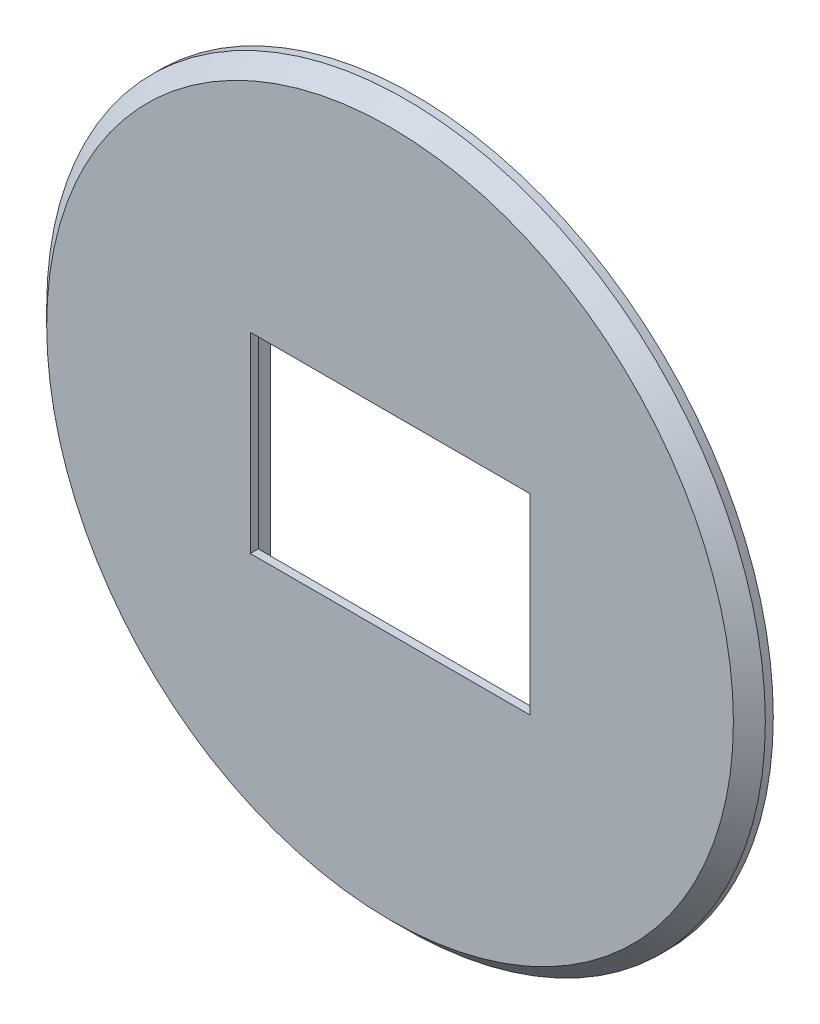
ISO-10303-21;
HEADER;
FILE_DESCRIPTION(('STEP AP214'),'2;1');
FILE_NAME('part.step','',(''),(''),'','','');
FILE_SCHEMA(('AUTOMOTIVE_DESIGN { 1 0 10303 214 1 1 1 1 }'));
ENDSEC;
DATA;
#1=APPLICATION_CONTEXT('core data for automotive mechanical design processes');
#2=APPLICATION_PROTOCOL_DEFINITION('international standard','automotive_design',2000,#1);
#3=PRODUCT_CONTEXT('',#1,'mechanical');
#4=PRODUCT('Part','Part','',(#3));
#5=PRODUCT_RELATED_PRODUCT_CATEGORY('part','',(#4));
#6=PRODUCT_DEFINITION_FORMATION('','',#4);
#7=PRODUCT_DEFINITION_CONTEXT('part definition',#1,'design');
#8=PRODUCT_DEFINITION('design','',#6,#7);
#9=PRODUCT_DEFINITION_SHAPE('','',#8);
#10=(LENGTH_UNIT() NAMED_UNIT(*) SI_UNIT(.MILLI.,.METRE.));
#11=(NAMED_UNIT(*) PLANE_ANGLE_UNIT() SI_UNIT($,.RADIAN.));
#12=(NAMED_UNIT(*) SI_UNIT($,.STERADIAN.) SOLID_ANGLE_UNIT());
#13=UNCERTAINTY_MEASURE_WITH_UNIT(LENGTH_MEASURE(1.E-05),#10,'distance_accuracy_value','');
#14=(GEOMETRIC_REPRESENTATION_CONTEXT(3) GLOBAL_UNCERTAINTY_ASSIGNED_CONTEXT((#13)) GLOBAL_UNIT_ASSIGNED_CONTEXT((#10,
#11,#12)) REPRESENTATION_CONTEXT('',''));
#15=CARTESIAN_POINT('',(0.,0.,0.));
#16=DIRECTION('',(0.,0.,1.));
#17=DIRECTION('',(1.,0.,0.));
#18=AXIS2_PLACEMENT_3D('',#15,#16,#17);
#19=CARTESIAN_POINT('',(17.5,12.,0.));
#20=DIRECTION('',(1.,0.,0.));
#21=DIRECTION('',(0.,0.,-1.));
#22=AXIS2_PLACEMENT_3D('',#19,#20,#21);
#23=PLANE('',#22);
#24=DIRECTION('',(0.,1.,0.));
#25=VECTOR('',#24,1.);
#26=CARTESIAN_POINT('',(17.5,12.,2.));
#27=LINE('',#26,#25);
#28=CARTESIAN_POINT('',(17.5,-12.,2.));
#29=VERTEX_POINT('',#28);
#30=CARTESIAN_POINT('',(17.5,12.,2.));
#31=VERTEX_POINT('',#30);
#32=EDGE_CURVE('E62',#29,#31,#27,.T.);
#33=ORIENTED_EDGE('',*,*,#32,.F.);
#34=DIRECTION('',(0.,0.,1.));
#35=VECTOR('',#34,1.);
#36=CARTESIAN_POINT('',(17.5,-12.,0.));
#37=LINE('',#36,#35);
#38=CARTESIAN_POINT('',(17.5,-12.,3.));
#39=VERTEX_POINT('',#38);
#40=EDGE_CURVE('E160',#29,#39,#37,.T.);
#41=ORIENTED_EDGE('',*,*,#40,.T.);
#42=DIRECTION('',(0.,1.,0.));
#43=VECTOR('',#42,1.);
#44=CARTESIAN_POINT('',(17.5,12.,3.));
#45=LINE('',#44,#43);
#46=CARTESIAN_POINT('',(17.5,12.,3.));
#47=VERTEX_POINT('',#46);
#48=EDGE_CURVE('E147',#39,#47,#45,.T.);
#49=ORIENTED_EDGE('',*,*,#48,.T.);
#50=DIRECTION('',(0.,0.,1.));
#51=VECTOR('',#50,1.);
#52=CARTESIAN_POINT('',(17.5,12.,0.));
#53=LINE('',#52,#51);
#54=EDGE_CURVE('E159',#31,#47,#53,.T.);
#55=ORIENTED_EDGE('',*,*,#54,.F.);
#56=EDGE_LOOP('',(#33,#41,#49,#55));
#57=FACE_BOUND('',#56,.T.);
#58=ADVANCED_FACE('F39',(#57),#23,.F.);
#59=CARTESIAN_POINT('',(-17.5,-12.,0.));
#60=DIRECTION('',(0.,-1.,0.));
#61=DIRECTION('',(0.,0.,-1.));
#62=AXIS2_PLACEMENT_3D('',#59,#60,#61);
#63=PLANE('',#62);
#64=DIRECTION('',(1.,0.,0.));
#65=VECTOR('',#64,1.);
#66=CARTESIAN_POINT('',(-17.5,-12.,2.));
#67=LINE('',#66,#65);
#68=CARTESIAN_POINT('',(-17.5,-12.,2.));
#69=VERTEX_POINT('',#68);
#70=EDGE_CURVE('E144',#69,#29,#67,.T.);
#71=ORIENTED_EDGE('',*,*,#70,.F.);
#72=DIRECTION('',(0.,0.,1.));
#73=VECTOR('',#72,1.);
#74=CARTESIAN_POINT('',(-17.5,-12.,0.));
#75=LINE('',#74,#73);
#76=CARTESIAN_POINT('',(-17.5,-12.,3.));
#77=VERTEX_POINT('',#76);
#78=EDGE_CURVE('E163',#69,#77,#75,.T.);
#79=ORIENTED_EDGE('',*,*,#78,.T.);
#80=DIRECTION('',(1.,0.,0.));
#81=VECTOR('',#80,1.);
#82=CARTESIAN_POINT('',(-17.5,-12.,3.));
#83=LINE('',#82,#81);
#84=EDGE_CURVE('E156',#77,#39,#83,.T.);
#85=ORIENTED_EDGE('',*,*,#84,.T.);
#86=ORIENTED_EDGE('',*,*,#40,.F.);
#87=EDGE_LOOP('',(#71,#79,#85,#86));
#88=FACE_BOUND('',#87,.T.);
#89=ADVANCED_FACE('F196',(#88),#63,.F.);
#90=CARTESIAN_POINT('',(-17.5,12.,0.));
#91=DIRECTION('',(-1.,0.,0.));
#92=DIRECTION('',(0.,0.,1.));
#93=AXIS2_PLACEMENT_3D('',#90,#91,#92);
#94=PLANE('',#93);
#95=DIRECTION('',(0.,-1.,0.));
#96=VECTOR('',#95,1.);
#97=CARTESIAN_POINT('',(-17.5,12.,2.));
#98=LINE('',#97,#96);
#99=CARTESIAN_POINT('',(-17.5,12.,2.));
#100=VERTEX_POINT('',#99);
#101=EDGE_CURVE('E139',#100,#69,#98,.T.);
#102=ORIENTED_EDGE('',*,*,#101,.F.);
#103=DIRECTION('',(0.,0.,1.));
#104=VECTOR('',#103,1.);
#105=CARTESIAN_POINT('',(-17.5,12.,0.));
#106=LINE('',#105,#104);
#107=CARTESIAN_POINT('',(-17.5,12.,3.));
#108=VERTEX_POINT('',#107);
#109=EDGE_CURVE('E165',#100,#108,#106,.T.);
#110=ORIENTED_EDGE('',*,*,#109,.T.);
#111=DIRECTION('',(0.,-1.,0.));
#112=VECTOR('',#111,1.);
#113=CARTESIAN_POINT('',(-17.5,12.,3.));
#114=LINE('',#113,#112);
#115=EDGE_CURVE('E153',#108,#77,#114,.T.);
#116=ORIENTED_EDGE('',*,*,#115,.T.);
#117=ORIENTED_EDGE('',*,*,#78,.F.);
#118=EDGE_LOOP('',(#102,#110,#116,#117));
#119=FACE_BOUND('',#118,.T.);
#120=ADVANCED_FACE('F200',(#119),#94,.F.);
#121=CARTESIAN_POINT('',(-17.5,12.,0.));
#122=DIRECTION('',(0.,1.,0.));
#123=DIRECTION('',(0.,0.,1.));
#124=AXIS2_PLACEMENT_3D('',#121,#122,#123);
#125=PLANE('',#124);
#126=DIRECTION('',(-1.,0.,0.));
#127=VECTOR('',#126,1.);
#128=CARTESIAN_POINT('',(-17.5,12.,2.));
#129=LINE('',#128,#127);
#130=EDGE_CURVE('E11',#31,#100,#129,.T.);
#131=ORIENTED_EDGE('',*,*,#130,.F.);
#132=ORIENTED_EDGE('',*,*,#54,.T.);
#133=DIRECTION('',(-1.,0.,0.));
#134=VECTOR('',#133,1.);
#135=CARTESIAN_POINT('',(-17.5,12.,3.));
#136=LINE('',#135,#134);
#137=EDGE_CURVE('E150',#47,#108,#136,.T.);
#138=ORIENTED_EDGE('',*,*,#137,.T.);
#139=ORIENTED_EDGE('',*,*,#109,.F.);
#140=EDGE_LOOP('',(#131,#132,#138,#139));
#141=FACE_BOUND('',#140,.T.);
#142=ADVANCED_FACE('F203',(#141),#125,.F.);
#143=CARTESIAN_POINT('',(0.,0.,3.));
#144=DIRECTION('',(0.,0.,-1.));
#145=DIRECTION('',(-1.,0.,0.));
#146=AXIS2_PLACEMENT_3D('',#143,#144,#145);
#147=CYLINDRICAL_SURFACE('',#146,45.);
#148=CARTESIAN_POINT('',(0.,0.,0.999999999999984));
#149=DIRECTION('',(0.,0.,1.));
#150=DIRECTION('',(1.,0.,0.));
#151=AXIS2_PLACEMENT_3D('',#148,#149,#150);
#152=CIRCLE('',#151,45.);
#153=CARTESIAN_POINT('',(45.,0.,0.999999999999984));
#154=VERTEX_POINT('',#153);
#155=EDGE_CURVE('E48',#154,#154,#152,.F.);
#156=ORIENTED_EDGE('',*,*,#155,.T.);
#157=EDGE_LOOP('',(#156));
#158=FACE_BOUND('',#157,.T.);
#159=CARTESIAN_POINT('',(0.,0.,0.));
#160=DIRECTION('',(0.,0.,1.));
#161=DIRECTION('',(1.,0.,0.));
#162=AXIS2_PLACEMENT_3D('',#159,#160,#161);
#163=CIRCLE('',#162,45.);
#164=CARTESIAN_POINT('',(45.,0.,0.));
#165=VERTEX_POINT('',#164);
#166=EDGE_CURVE('E162',#165,#165,#163,.T.);
#167=ORIENTED_EDGE('',*,*,#166,.T.);
#168=EDGE_LOOP('',(#167));
#169=FACE_BOUND('',#168,.T.);
#170=ADVANCED_FACE('F175',(#158,#169),#147,.T.);
#171=CARTESIAN_POINT('',(0.,0.,3.));
#172=DIRECTION('',(0.,0.,1.));
#173=DIRECTION('',(1.,0.,0.));
#174=AXIS2_PLACEMENT_3D('',#171,#172,#173);
#175=PLANE('',#174);
#176=CARTESIAN_POINT('',(0.,0.,3.));
#177=DIRECTION('',(0.,0.,1.));
#178=DIRECTION('',(1.,0.,0.));
#179=AXIS2_PLACEMENT_3D('',#176,#177,#178);
#180=CIRCLE('',#179,43.);
#181=CARTESIAN_POINT('',(43.,0.,3.));
#182=VERTEX_POINT('',#181);
#183=EDGE_CURVE('E170',#182,#182,#180,.T.);
#184=ORIENTED_EDGE('',*,*,#183,.T.);
#185=EDGE_LOOP('',(#184));
#186=FACE_BOUND('',#185,.T.);
#187=ORIENTED_EDGE('',*,*,#48,.F.);
#188=ORIENTED_EDGE('',*,*,#84,.F.);
#189=ORIENTED_EDGE('',*,*,#115,.F.);
#190=ORIENTED_EDGE('',*,*,#137,.F.);
#191=EDGE_LOOP('',(#187,#188,#189,#190));
#192=FACE_BOUND('',#191,.T.);
#193=ADVANCED_FACE('F183',(#186,#192),#175,.T.);
#194=CARTESIAN_POINT('',(0.,0.,0.));
#195=DIRECTION('',(0.,0.,1.));
#196=DIRECTION('',(1.,0.,0.));
#197=AXIS2_PLACEMENT_3D('',#194,#195,#196);
#198=PLANE('',#197);
#199=DIRECTION('',(1.,0.,0.));
#200=VECTOR('',#199,1.);
#201=CARTESIAN_POINT('',(18.,17.,0.));
#202=LINE('',#201,#200);
#203=CARTESIAN_POINT('',(-18.,17.,0.));
#204=VERTEX_POINT('',#203);
#205=CARTESIAN_POINT('',(18.,17.,0.));
#206=VERTEX_POINT('',#205);
#207=EDGE_CURVE('E133',#204,#206,#202,.T.);
#208=ORIENTED_EDGE('',*,*,#207,.F.);
#209=DIRECTION('',(0.,1.,0.));
#210=VECTOR('',#209,1.);
#211=CARTESIAN_POINT('',(-18.,17.,0.));
#212=LINE('',#211,#210);
#213=CARTESIAN_POINT('',(-18.,-17.,0.));
#214=VERTEX_POINT('',#213);
#215=EDGE_CURVE('E55',#214,#204,#212,.T.);
#216=ORIENTED_EDGE('',*,*,#215,.F.);
#217=DIRECTION('',(-1.,0.,0.));
#218=VECTOR('',#217,1.);
#219=CARTESIAN_POINT('',(18.,-17.,0.));
#220=LINE('',#219,#218);
#221=CARTESIAN_POINT('',(18.,-17.,0.));
#222=VERTEX_POINT('',#221);
#223=EDGE_CURVE('E124',#222,#214,#220,.T.);
#224=ORIENTED_EDGE('',*,*,#223,.F.);
#225=DIRECTION('',(0.,-1.,0.));
#226=VECTOR('',#225,1.);
#227=CARTESIAN_POINT('',(18.,17.,0.));
#228=LINE('',#227,#226);
#229=EDGE_CURVE('E127',#206,#222,#228,.T.);
#230=ORIENTED_EDGE('',*,*,#229,.F.);
#231=EDGE_LOOP('',(#208,#216,#224,#230));
#232=FACE_BOUND('',#231,.T.);
#233=ORIENTED_EDGE('',*,*,#166,.F.);
#234=EDGE_LOOP('',(#233));
#235=FACE_BOUND('',#234,.T.);
#236=ADVANCED_FACE('F180',(#232,#235),#198,.F.);
#237=CARTESIAN_POINT('',(0.,0.,3.));
#238=DIRECTION('',(0.,0.,-1.));
#239=DIRECTION('',(-1.,0.,0.));
#240=AXIS2_PLACEMENT_3D('',#237,#238,#239);
#241=CONICAL_SURFACE('',#240,43.,0.785398163397443);
#242=ORIENTED_EDGE('',*,*,#155,.F.);
#243=EDGE_LOOP('',(#242));
#244=FACE_BOUND('',#243,.T.);
#245=ORIENTED_EDGE('',*,*,#183,.F.);
#246=EDGE_LOOP('',(#245));
#247=FACE_BOUND('',#246,.T.);
#248=ADVANCED_FACE('F42',(#244,#247),#241,.T.);
#249=CARTESIAN_POINT('',(0.,0.,2.));
#250=DIRECTION('',(0.,0.,-1.));
#251=DIRECTION('',(-1.,0.,0.));
#252=AXIS2_PLACEMENT_3D('',#249,#250,#251);
#253=PLANE('',#252);
#254=DIRECTION('',(0.,1.,0.));
#255=VECTOR('',#254,1.);
#256=CARTESIAN_POINT('',(-18.,17.,2.));
#257=LINE('',#256,#255);
#258=CARTESIAN_POINT('',(-18.,-17.,2.));
#259=VERTEX_POINT('',#258);
#260=CARTESIAN_POINT('',(-18.,17.,2.));
#261=VERTEX_POINT('',#260);
#262=EDGE_CURVE('E106',#259,#261,#257,.T.);
#263=ORIENTED_EDGE('',*,*,#262,.T.);
#264=DIRECTION('',(1.,0.,0.));
#265=VECTOR('',#264,1.);
#266=CARTESIAN_POINT('',(18.,17.,2.));
#267=LINE('',#266,#265);
#268=CARTESIAN_POINT('',(18.,17.,2.));
#269=VERTEX_POINT('',#268);
#270=EDGE_CURVE('E115',#261,#269,#267,.T.);
#271=ORIENTED_EDGE('',*,*,#270,.T.);
#272=DIRECTION('',(0.,-1.,0.));
#273=VECTOR('',#272,1.);
#274=CARTESIAN_POINT('',(18.,17.,2.));
#275=LINE('',#274,#273);
#276=CARTESIAN_POINT('',(18.,-17.,2.));
#277=VERTEX_POINT('',#276);
#278=EDGE_CURVE('E120',#269,#277,#275,.T.);
#279=ORIENTED_EDGE('',*,*,#278,.T.);
#280=DIRECTION('',(-1.,0.,0.));
#281=VECTOR('',#280,1.);
#282=CARTESIAN_POINT('',(18.,-17.,2.));
#283=LINE('',#282,#281);
#284=EDGE_CURVE('E112',#277,#259,#283,.T.);
#285=ORIENTED_EDGE('',*,*,#284,.T.);
#286=EDGE_LOOP('',(#263,#271,#279,#285));
#287=FACE_BOUND('',#286,.T.);
#288=ORIENTED_EDGE('',*,*,#32,.T.);
#289=ORIENTED_EDGE('',*,*,#130,.T.);
#290=ORIENTED_EDGE('',*,*,#101,.T.);
#291=ORIENTED_EDGE('',*,*,#70,.T.);
#292=EDGE_LOOP('',(#288,#289,#290,#291));
#293=FACE_BOUND('',#292,.T.);
#294=ADVANCED_FACE('F122',(#287,#293),#253,.T.);
#295=CARTESIAN_POINT('',(-18.,17.,2.));
#296=DIRECTION('',(-1.,0.,0.));
#297=DIRECTION('',(0.,-1.,0.));
#298=AXIS2_PLACEMENT_3D('',#295,#296,#297);
#299=PLANE('',#298);
#300=ORIENTED_EDGE('',*,*,#215,.T.);
#301=DIRECTION('',(0.,0.,-1.));
#302=VECTOR('',#301,1.);
#303=CARTESIAN_POINT('',(-18.,17.,2.));
#304=LINE('',#303,#302);
#305=EDGE_CURVE('E102',#261,#204,#304,.T.);
#306=ORIENTED_EDGE('',*,*,#305,.F.);
#307=ORIENTED_EDGE('',*,*,#262,.F.);
#308=DIRECTION('',(0.,0.,-1.));
#309=VECTOR('',#308,1.);
#310=CARTESIAN_POINT('',(-18.,-17.,2.));
#311=LINE('',#310,#309);
#312=EDGE_CURVE('E137',#259,#214,#311,.T.);
#313=ORIENTED_EDGE('',*,*,#312,.T.);
#314=EDGE_LOOP('',(#300,#306,#307,#313));
#315=FACE_BOUND('',#314,.T.);
#316=ADVANCED_FACE('F104',(#315),#299,.F.);
#317=CARTESIAN_POINT('',(18.,-17.,2.));
#318=DIRECTION('',(0.,-1.,0.));
#319=DIRECTION('',(0.,0.,-1.));
#320=AXIS2_PLACEMENT_3D('',#317,#318,#319);
#321=PLANE('',#320);
#322=ORIENTED_EDGE('',*,*,#223,.T.);
#323=ORIENTED_EDGE('',*,*,#312,.F.);
#324=ORIENTED_EDGE('',*,*,#284,.F.);
#325=DIRECTION('',(0.,0.,-1.));
#326=VECTOR('',#325,1.);
#327=CARTESIAN_POINT('',(18.,-17.,2.));
#328=LINE('',#327,#326);
#329=EDGE_CURVE('E140',#277,#222,#328,.T.);
#330=ORIENTED_EDGE('',*,*,#329,.T.);
#331=EDGE_LOOP('',(#322,#323,#324,#330));
#332=FACE_BOUND('',#331,.T.);
#333=ADVANCED_FACE('F210',(#332),#321,.F.);
#334=CARTESIAN_POINT('',(18.,17.,2.));
#335=DIRECTION('',(1.,0.,0.));
#336=DIRECTION('',(0.,1.,0.));
#337=AXIS2_PLACEMENT_3D('',#334,#335,#336);
#338=PLANE('',#337);
#339=ORIENTED_EDGE('',*,*,#229,.T.);
#340=ORIENTED_EDGE('',*,*,#329,.F.);
#341=ORIENTED_EDGE('',*,*,#278,.F.);
#342=DIRECTION('',(0.,0.,-1.));
#343=VECTOR('',#342,1.);
#344=CARTESIAN_POINT('',(18.,17.,2.));
#345=LINE('',#344,#343);
#346=EDGE_CURVE('E111',#269,#206,#345,.T.);
#347=ORIENTED_EDGE('',*,*,#346,.T.);
#348=EDGE_LOOP('',(#339,#340,#341,#347));
#349=FACE_BOUND('',#348,.T.);
#350=ADVANCED_FACE('F237',(#349),#338,.F.);
#351=CARTESIAN_POINT('',(18.,17.,2.));
#352=DIRECTION('',(0.,1.,0.));
#353=DIRECTION('',(0.,0.,1.));
#354=AXIS2_PLACEMENT_3D('',#351,#352,#353);
#355=PLANE('',#354);
#356=ORIENTED_EDGE('',*,*,#207,.T.);
#357=ORIENTED_EDGE('',*,*,#346,.F.);
#358=ORIENTED_EDGE('',*,*,#270,.F.);
#359=ORIENTED_EDGE('',*,*,#305,.T.);
#360=EDGE_LOOP('',(#356,#357,#358,#359));
#361=FACE_BOUND('',#360,.T.);
#362=ADVANCED_FACE('F116',(#361),#355,.F.);
#363=CLOSED_SHELL('',(#58,#89,#120,#142,#170,#193,#236,#248,#294,#316,#333,#350,#362));
#364=MANIFOLD_SOLID_BREP('B2',#363);
#365=ADVANCED_BREP_SHAPE_REPRESENTATION('',(#18,#364),#14);
#366=SHAPE_DEFINITION_REPRESENTATION(#9,#365);
ENDSEC;
END-ISO-10303-21;
